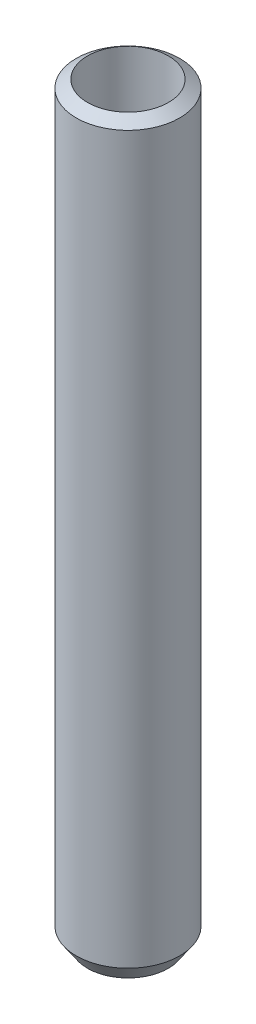
ISO-10303-21;
HEADER;
FILE_DESCRIPTION(('STEP AP214'),'2;1');
FILE_NAME('part.step','',(''),(''),'','','');
FILE_SCHEMA(('AUTOMOTIVE_DESIGN { 1 0 10303 214 1 1 1 1 }'));
ENDSEC;
DATA;
#1=APPLICATION_CONTEXT('core data for automotive mechanical design processes');
#2=APPLICATION_PROTOCOL_DEFINITION('international standard','automotive_design',2000,#1);
#3=PRODUCT_CONTEXT('',#1,'mechanical');
#4=PRODUCT('Part','Part','',(#3));
#5=PRODUCT_RELATED_PRODUCT_CATEGORY('part','',(#4));
#6=PRODUCT_DEFINITION_FORMATION('','',#4);
#7=PRODUCT_DEFINITION_CONTEXT('part definition',#1,'design');
#8=PRODUCT_DEFINITION('design','',#6,#7);
#9=PRODUCT_DEFINITION_SHAPE('','',#8);
#10=(LENGTH_UNIT() NAMED_UNIT(*) SI_UNIT(.MILLI.,.METRE.));
#11=(NAMED_UNIT(*) PLANE_ANGLE_UNIT() SI_UNIT($,.RADIAN.));
#12=(NAMED_UNIT(*) SI_UNIT($,.STERADIAN.) SOLID_ANGLE_UNIT());
#13=UNCERTAINTY_MEASURE_WITH_UNIT(LENGTH_MEASURE(1.E-05),#10,'distance_accuracy_value','');
#14=(GEOMETRIC_REPRESENTATION_CONTEXT(3) GLOBAL_UNCERTAINTY_ASSIGNED_CONTEXT((#13)) GLOBAL_UNIT_ASSIGNED_CONTEXT((#10,
#11,#12)) REPRESENTATION_CONTEXT('',''));
#15=CARTESIAN_POINT('',(0.,0.,0.));
#16=DIRECTION('',(0.,0.,1.));
#17=DIRECTION('',(1.,0.,0.));
#18=AXIS2_PLACEMENT_3D('',#15,#16,#17);
#19=CARTESIAN_POINT('',(0.,364.69268610809,0.));
#20=DIRECTION('',(0.,-1.,0.));
#21=DIRECTION('',(0.,0.,-1.));
#22=AXIS2_PLACEMENT_3D('',#19,#20,#21);
#23=CYLINDRICAL_SURFACE('',#22,25.);
#24=CARTESIAN_POINT('',(0.,359.081971470309,0.));
#25=DIRECTION('',(0.,1.,0.));
#26=DIRECTION('',(0.,0.,1.));
#27=AXIS2_PLACEMENT_3D('',#24,#25,#26);
#28=CIRCLE('',#27,25.);
#29=CARTESIAN_POINT('',(0.,359.081971470309,25.));
#30=VERTEX_POINT('',#29);
#31=EDGE_CURVE('E10',#30,#30,#28,.F.);
#32=ORIENTED_EDGE('',*,*,#31,.T.);
#33=EDGE_LOOP('',(#32));
#34=FACE_BOUND('',#33,.T.);
#35=CARTESIAN_POINT('',(0.,8.1836161008082,0.));
#36=DIRECTION('',(0.,1.,0.));
#37=DIRECTION('',(0.,0.,1.));
#38=AXIS2_PLACEMENT_3D('',#35,#36,#37);
#39=CIRCLE('',#38,25.);
#40=CARTESIAN_POINT('',(0.,8.1836161008082,25.));
#41=VERTEX_POINT('',#40);
#42=EDGE_CURVE('E50',#41,#41,#39,.T.);
#43=ORIENTED_EDGE('',*,*,#42,.T.);
#44=EDGE_LOOP('',(#43));
#45=FACE_BOUND('',#44,.T.);
#46=ADVANCED_FACE('F39',(#34,#45),#23,.T.);
#47=CARTESIAN_POINT('',(0.,364.69268610809,0.));
#48=DIRECTION('',(0.,-1.,0.));
#49=DIRECTION('',(0.,0.,-1.));
#50=AXIS2_PLACEMENT_3D('',#47,#48,#49);
#51=CYLINDRICAL_SURFACE('',#50,19.5440341047172);
#52=CARTESIAN_POINT('',(0.,362.82259998157,0.));
#53=DIRECTION('',(0.,-1.,0.));
#54=DIRECTION('',(0.,0.,-1.));
#55=AXIS2_PLACEMENT_3D('',#52,#53,#54);
#56=CIRCLE('',#55,19.5440341047172);
#57=CARTESIAN_POINT('',(0.,362.82259998157,-19.5440341047172));
#58=VERTEX_POINT('',#57);
#59=EDGE_CURVE('E51',#58,#58,#56,.F.);
#60=ORIENTED_EDGE('',*,*,#59,.T.);
#61=EDGE_LOOP('',(#60));
#62=FACE_BOUND('',#61,.T.);
#63=CARTESIAN_POINT('',(0.,0.225711764444796,0.));
#64=DIRECTION('',(0.,1.,0.));
#65=DIRECTION('',(0.,0.,1.));
#66=AXIS2_PLACEMENT_3D('',#63,#64,#65);
#67=CIRCLE('',#66,19.5440341047172);
#68=CARTESIAN_POINT('',(0.,0.225711764444796,19.5440341047172));
#69=VERTEX_POINT('',#68);
#70=EDGE_CURVE('E54',#69,#69,#67,.F.);
#71=ORIENTED_EDGE('',*,*,#70,.T.);
#72=EDGE_LOOP('',(#71));
#73=FACE_BOUND('',#72,.T.);
#74=ADVANCED_FACE('F63',(#62,#73),#51,.F.);
#75=CARTESIAN_POINT('',(0.,364.69268610809,0.));
#76=DIRECTION('',(0.,-1.,0.));
#77=DIRECTION('',(0.,0.,-1.));
#78=AXIS2_PLACEMENT_3D('',#75,#76,#77);
#79=CONICAL_SURFACE('',#78,16.8163838991918,0.969798030207);
#80=ORIENTED_EDGE('',*,*,#31,.F.);
#81=EDGE_LOOP('',(#80));
#82=FACE_BOUND('',#81,.T.);
#83=ORIENTED_EDGE('',*,*,#59,.F.);
#84=EDGE_LOOP('',(#83));
#85=FACE_BOUND('',#84,.T.);
#86=ADVANCED_FACE('F64',(#82,#85),#79,.T.);
#87=CARTESIAN_POINT('',(0.,8.1836161008082,0.));
#88=DIRECTION('',(0.,1.,0.));
#89=DIRECTION('',(0.,0.,1.));
#90=AXIS2_PLACEMENT_3D('',#87,#88,#89);
#91=CONICAL_SURFACE('',#90,25.,0.600998296587895);
#92=ORIENTED_EDGE('',*,*,#70,.F.);
#93=EDGE_LOOP('',(#92));
#94=FACE_BOUND('',#93,.T.);
#95=ORIENTED_EDGE('',*,*,#42,.F.);
#96=EDGE_LOOP('',(#95));
#97=FACE_BOUND('',#96,.T.);
#98=ADVANCED_FACE('F45',(#94,#97),#91,.T.);
#99=CLOSED_SHELL('',(#46,#74,#86,#98));
#100=MANIFOLD_SOLID_BREP('B2',#99);
#101=ADVANCED_BREP_SHAPE_REPRESENTATION('',(#18,#100),#14);
#102=SHAPE_DEFINITION_REPRESENTATION(#9,#101);
ENDSEC;
END-ISO-10303-21;
